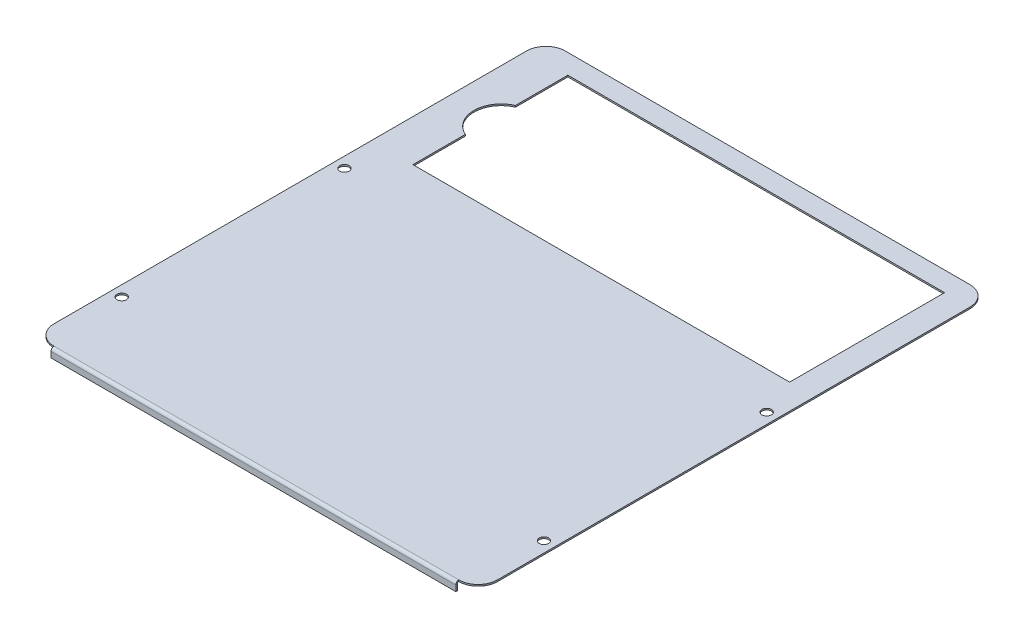
ISO-10303-21;
HEADER;
FILE_DESCRIPTION(('STEP AP214'),'2;1');
FILE_NAME('part.step','',(''),(''),'','','');
FILE_SCHEMA(('AUTOMOTIVE_DESIGN { 1 0 10303 214 1 1 1 1 }'));
ENDSEC;
DATA;
#1=APPLICATION_CONTEXT('core data for automotive mechanical design processes');
#2=APPLICATION_PROTOCOL_DEFINITION('international standard','automotive_design',2000,#1);
#3=PRODUCT_CONTEXT('',#1,'mechanical');
#4=PRODUCT('Part','Part','',(#3));
#5=PRODUCT_RELATED_PRODUCT_CATEGORY('part','',(#4));
#6=PRODUCT_DEFINITION_FORMATION('','',#4);
#7=PRODUCT_DEFINITION_CONTEXT('part definition',#1,'design');
#8=PRODUCT_DEFINITION('design','',#6,#7);
#9=PRODUCT_DEFINITION_SHAPE('','',#8);
#10=(LENGTH_UNIT() NAMED_UNIT(*) SI_UNIT(.MILLI.,.METRE.));
#11=(NAMED_UNIT(*) PLANE_ANGLE_UNIT() SI_UNIT($,.RADIAN.));
#12=(NAMED_UNIT(*) SI_UNIT($,.STERADIAN.) SOLID_ANGLE_UNIT());
#13=UNCERTAINTY_MEASURE_WITH_UNIT(LENGTH_MEASURE(1.E-05),#10,'distance_accuracy_value','');
#14=(GEOMETRIC_REPRESENTATION_CONTEXT(3) GLOBAL_UNCERTAINTY_ASSIGNED_CONTEXT((#13)) GLOBAL_UNIT_ASSIGNED_CONTEXT((#10,
#11,#12)) REPRESENTATION_CONTEXT('',''));
#15=CARTESIAN_POINT('',(0.,0.,0.));
#16=DIRECTION('',(0.,0.,1.));
#17=DIRECTION('',(1.,0.,0.));
#18=AXIS2_PLACEMENT_3D('',#15,#16,#17);
#19=CARTESIAN_POINT('',(114.5,-0.8,132.));
#20=DIRECTION('',(0.,1.,0.));
#21=DIRECTION('',(0.,0.,1.));
#22=AXIS2_PLACEMENT_3D('',#19,#20,#21);
#23=PLANE('',#22);
#24=DIRECTION('',(1.,0.,0.));
#25=VECTOR('',#24,1.);
#26=CARTESIAN_POINT('',(114.5,-0.8,-41.85));
#27=LINE('',#26,#25);
#28=CARTESIAN_POINT('',(-93.,-0.8,-41.85));
#29=VERTEX_POINT('',#28);
#30=CARTESIAN_POINT('',(101.5,-0.8,-41.85));
#31=VERTEX_POINT('',#30);
#32=EDGE_CURVE('E228',#29,#31,#27,.T.);
#33=ORIENTED_EDGE('',*,*,#32,.T.);
#34=DIRECTION('',(0.,0.,-1.));
#35=VECTOR('',#34,1.);
#36=CARTESIAN_POINT('',(101.5,-0.8,132.));
#37=LINE('',#36,#35);
#38=CARTESIAN_POINT('',(101.5,-0.8,-121.85));
#39=VERTEX_POINT('',#38);
#40=EDGE_CURVE('E231',#31,#39,#37,.T.);
#41=ORIENTED_EDGE('',*,*,#40,.T.);
#42=DIRECTION('',(-1.,0.,0.));
#43=VECTOR('',#42,1.);
#44=CARTESIAN_POINT('',(114.5,-0.8,-121.85));
#45=LINE('',#44,#43);
#46=CARTESIAN_POINT('',(-93.,-0.8,-121.85));
#47=VERTEX_POINT('',#46);
#48=EDGE_CURVE('E213',#39,#47,#45,.T.);
#49=ORIENTED_EDGE('',*,*,#48,.T.);
#50=DIRECTION('',(0.,0.,1.));
#51=VECTOR('',#50,1.);
#52=CARTESIAN_POINT('',(-93.,-0.8,132.));
#53=LINE('',#52,#51);
#54=CARTESIAN_POINT('',(-93.,-0.8,-94.8));
#55=VERTEX_POINT('',#54);
#56=EDGE_CURVE('E186',#47,#55,#53,.T.);
#57=ORIENTED_EDGE('',*,*,#56,.T.);
#58=CARTESIAN_POINT('',(-87.3851470588235,-0.8,-81.85));
#59=DIRECTION('',(0.,1.,0.));
#60=DIRECTION('',(0.,0.,1.));
#61=AXIS2_PLACEMENT_3D('',#58,#59,#60);
#62=CIRCLE('',#61,14.1148529411765);
#63=CARTESIAN_POINT('',(-93.,-0.8,-68.9));
#64=VERTEX_POINT('',#63);
#65=EDGE_CURVE('E222',#55,#64,#62,.T.);
#66=ORIENTED_EDGE('',*,*,#65,.T.);
#67=DIRECTION('',(0.,0.,1.));
#68=VECTOR('',#67,1.);
#69=CARTESIAN_POINT('',(-92.9999999999999,-0.8,132.));
#70=LINE('',#69,#68);
#71=EDGE_CURVE('E225',#64,#29,#70,.T.);
#72=ORIENTED_EDGE('',*,*,#71,.T.);
#73=EDGE_LOOP('',(#33,#41,#49,#57,#66,#72));
#74=FACE_BOUND('',#73,.T.);
#75=CARTESIAN_POINT('',(109.,-0.8,92.5));
#76=DIRECTION('',(0.,1.,0.));
#77=DIRECTION('',(0.,0.,1.));
#78=AXIS2_PLACEMENT_3D('',#75,#76,#77);
#79=CIRCLE('',#78,2.45);
#80=CARTESIAN_POINT('',(109.,-0.8,94.95));
#81=VERTEX_POINT('',#80);
#82=EDGE_CURVE('E243',#81,#81,#79,.F.);
#83=ORIENTED_EDGE('',*,*,#82,.F.);
#84=EDGE_LOOP('',(#83));
#85=FACE_BOUND('',#84,.T.);
#86=CARTESIAN_POINT('',(109.,-0.8,-22.5));
#87=DIRECTION('',(0.,1.,0.));
#88=DIRECTION('',(0.,0.,1.));
#89=AXIS2_PLACEMENT_3D('',#86,#87,#88);
#90=CIRCLE('',#89,2.45);
#91=CARTESIAN_POINT('',(109.,-0.8,-20.05));
#92=VERTEX_POINT('',#91);
#93=EDGE_CURVE('E238',#92,#92,#90,.F.);
#94=ORIENTED_EDGE('',*,*,#93,.F.);
#95=EDGE_LOOP('',(#94));
#96=FACE_BOUND('',#95,.T.);
#97=CARTESIAN_POINT('',(-109.,-0.8,92.5));
#98=DIRECTION('',(0.,1.,0.));
#99=DIRECTION('',(0.,0.,1.));
#100=AXIS2_PLACEMENT_3D('',#97,#98,#99);
#101=CIRCLE('',#100,2.45);
#102=CARTESIAN_POINT('',(-109.,-0.8,94.95));
#103=VERTEX_POINT('',#102);
#104=EDGE_CURVE('E255',#103,#103,#101,.T.);
#105=ORIENTED_EDGE('',*,*,#104,.T.);
#106=EDGE_LOOP('',(#105));
#107=FACE_BOUND('',#106,.T.);
#108=CARTESIAN_POINT('',(-109.,-0.8,-22.5));
#109=DIRECTION('',(0.,1.,0.));
#110=DIRECTION('',(0.,0.,1.));
#111=AXIS2_PLACEMENT_3D('',#108,#109,#110);
#112=CIRCLE('',#111,2.45);
#113=CARTESIAN_POINT('',(-109.,-0.8,-20.05));
#114=VERTEX_POINT('',#113);
#115=EDGE_CURVE('E250',#114,#114,#112,.T.);
#116=ORIENTED_EDGE('',*,*,#115,.T.);
#117=EDGE_LOOP('',(#116));
#118=FACE_BOUND('',#117,.T.);
#119=DIRECTION('',(-1.,0.,0.));
#120=VECTOR('',#119,1.);
#121=CARTESIAN_POINT('',(114.5,-0.8,132.));
#122=LINE('',#121,#120);
#123=CARTESIAN_POINT('',(104.5,-0.8,132.));
#124=VERTEX_POINT('',#123);
#125=CARTESIAN_POINT('',(-104.5,-0.8,132.));
#126=VERTEX_POINT('',#125);
#127=EDGE_CURVE('E312',#124,#126,#122,.T.);
#128=ORIENTED_EDGE('',*,*,#127,.T.);
#129=CARTESIAN_POINT('',(-104.5,-0.8,122.));
#130=DIRECTION('',(0.,1.,0.));
#131=DIRECTION('',(0.,0.,1.));
#132=AXIS2_PLACEMENT_3D('',#129,#130,#131);
#133=CIRCLE('',#132,10.);
#134=CARTESIAN_POINT('',(-114.5,-0.8,122.));
#135=VERTEX_POINT('',#134);
#136=EDGE_CURVE('E350',#126,#135,#133,.F.);
#137=ORIENTED_EDGE('',*,*,#136,.T.);
#138=DIRECTION('',(0.,0.,-1.));
#139=VECTOR('',#138,1.);
#140=CARTESIAN_POINT('',(-114.5,-0.8,132.));
#141=LINE('',#140,#139);
#142=CARTESIAN_POINT('',(-114.5,-0.8,-122.));
#143=VERTEX_POINT('',#142);
#144=EDGE_CURVE('E292',#135,#143,#141,.T.);
#145=ORIENTED_EDGE('',*,*,#144,.T.);
#146=CARTESIAN_POINT('',(-104.5,-0.8,-122.));
#147=DIRECTION('',(0.,1.,0.));
#148=DIRECTION('',(0.,0.,1.));
#149=AXIS2_PLACEMENT_3D('',#146,#147,#148);
#150=CIRCLE('',#149,10.);
#151=CARTESIAN_POINT('',(-104.5,-0.8,-132.));
#152=VERTEX_POINT('',#151);
#153=EDGE_CURVE('E348',#143,#152,#150,.F.);
#154=ORIENTED_EDGE('',*,*,#153,.T.);
#155=DIRECTION('',(-1.,0.,0.));
#156=VECTOR('',#155,1.);
#157=CARTESIAN_POINT('',(114.5,-0.8,-132.));
#158=LINE('',#157,#156);
#159=CARTESIAN_POINT('',(104.5,-0.8,-132.));
#160=VERTEX_POINT('',#159);
#161=EDGE_CURVE('E320',#160,#152,#158,.T.);
#162=ORIENTED_EDGE('',*,*,#161,.F.);
#163=CARTESIAN_POINT('',(104.5,-0.8,-122.));
#164=DIRECTION('',(0.,1.,0.));
#165=DIRECTION('',(0.,0.,1.));
#166=AXIS2_PLACEMENT_3D('',#163,#164,#165);
#167=CIRCLE('',#166,10.);
#168=CARTESIAN_POINT('',(114.5,-0.8,-122.));
#169=VERTEX_POINT('',#168);
#170=EDGE_CURVE('E346',#160,#169,#167,.F.);
#171=ORIENTED_EDGE('',*,*,#170,.T.);
#172=DIRECTION('',(0.,0.,-1.));
#173=VECTOR('',#172,1.);
#174=CARTESIAN_POINT('',(114.5,-0.8,132.));
#175=LINE('',#174,#173);
#176=CARTESIAN_POINT('',(114.5,-0.8,122.));
#177=VERTEX_POINT('',#176);
#178=EDGE_CURVE('E306',#177,#169,#175,.T.);
#179=ORIENTED_EDGE('',*,*,#178,.F.);
#180=CARTESIAN_POINT('',(104.5,-0.8,122.));
#181=DIRECTION('',(0.,1.,0.));
#182=DIRECTION('',(0.,0.,1.));
#183=AXIS2_PLACEMENT_3D('',#180,#181,#182);
#184=CIRCLE('',#183,10.);
#185=EDGE_CURVE('E344',#177,#124,#184,.F.);
#186=ORIENTED_EDGE('',*,*,#185,.T.);
#187=EDGE_LOOP('',(#128,#137,#145,#154,#162,#171,#179,#186));
#188=FACE_BOUND('',#187,.T.);
#189=ADVANCED_FACE('F56',(#74,#85,#96,#107,#118,#188),#23,.F.);
#190=CARTESIAN_POINT('',(114.5,0.,-132.));
#191=DIRECTION('',(0.,0.,-1.));
#192=DIRECTION('',(-1.,0.,0.));
#193=AXIS2_PLACEMENT_3D('',#190,#191,#192);
#194=PLANE('',#193);
#195=ORIENTED_EDGE('',*,*,#161,.T.);
#196=DIRECTION('',(0.,-1.,0.));
#197=VECTOR('',#196,1.);
#198=CARTESIAN_POINT('',(-104.5,0.,-132.));
#199=LINE('',#198,#197);
#200=CARTESIAN_POINT('',(-104.5,0.,-132.));
#201=VERTEX_POINT('',#200);
#202=EDGE_CURVE('E355',#152,#201,#199,.F.);
#203=ORIENTED_EDGE('',*,*,#202,.T.);
#204=DIRECTION('',(-1.,0.,0.));
#205=VECTOR('',#204,1.);
#206=CARTESIAN_POINT('',(114.5,0.,-132.));
#207=LINE('',#206,#205);
#208=CARTESIAN_POINT('',(104.5,0.,-132.));
#209=VERTEX_POINT('',#208);
#210=EDGE_CURVE('E317',#209,#201,#207,.T.);
#211=ORIENTED_EDGE('',*,*,#210,.F.);
#212=DIRECTION('',(0.,-1.,0.));
#213=VECTOR('',#212,1.);
#214=CARTESIAN_POINT('',(104.5,-0.8,-132.));
#215=LINE('',#214,#213);
#216=EDGE_CURVE('E352',#209,#160,#215,.T.);
#217=ORIENTED_EDGE('',*,*,#216,.T.);
#218=EDGE_LOOP('',(#195,#203,#211,#217));
#219=FACE_BOUND('',#218,.T.);
#220=ADVANCED_FACE('F410',(#219),#194,.T.);
#221=CARTESIAN_POINT('',(114.5,0.,132.));
#222=DIRECTION('',(0.,1.,0.));
#223=DIRECTION('',(0.,0.,1.));
#224=AXIS2_PLACEMENT_3D('',#221,#222,#223);
#225=PLANE('',#224);
#226=DIRECTION('',(0.,0.,-1.));
#227=VECTOR('',#226,1.);
#228=CARTESIAN_POINT('',(101.5,0.,-121.85));
#229=LINE('',#228,#227);
#230=CARTESIAN_POINT('',(101.5,0.,-41.85));
#231=VERTEX_POINT('',#230);
#232=CARTESIAN_POINT('',(101.5,0.,-121.85));
#233=VERTEX_POINT('',#232);
#234=EDGE_CURVE('E79',#231,#233,#229,.T.);
#235=ORIENTED_EDGE('',*,*,#234,.F.);
#236=DIRECTION('',(1.,0.,0.));
#237=VECTOR('',#236,1.);
#238=CARTESIAN_POINT('',(-93.,0.,-41.85));
#239=LINE('',#238,#237);
#240=CARTESIAN_POINT('',(-93.,0.,-41.85));
#241=VERTEX_POINT('',#240);
#242=EDGE_CURVE('E208',#241,#231,#239,.T.);
#243=ORIENTED_EDGE('',*,*,#242,.F.);
#244=DIRECTION('',(0.,0.,1.));
#245=VECTOR('',#244,1.);
#246=CARTESIAN_POINT('',(-93.,0.,-68.9));
#247=LINE('',#246,#245);
#248=CARTESIAN_POINT('',(-93.,0.,-68.9));
#249=VERTEX_POINT('',#248);
#250=EDGE_CURVE('E202',#249,#241,#247,.T.);
#251=ORIENTED_EDGE('',*,*,#250,.F.);
#252=CARTESIAN_POINT('',(-87.3851470588235,0.,-81.85));
#253=DIRECTION('',(0.,1.,0.));
#254=DIRECTION('',(0.,0.,-1.));
#255=AXIS2_PLACEMENT_3D('',#252,#253,#254);
#256=CIRCLE('',#255,14.1148529411765);
#257=CARTESIAN_POINT('',(-93.,0.,-94.8));
#258=VERTEX_POINT('',#257);
#259=EDGE_CURVE('E200',#258,#249,#256,.T.);
#260=ORIENTED_EDGE('',*,*,#259,.F.);
#261=DIRECTION('',(0.,0.,1.));
#262=VECTOR('',#261,1.);
#263=CARTESIAN_POINT('',(-93.,0.,-121.85));
#264=LINE('',#263,#262);
#265=CARTESIAN_POINT('',(-93.,0.,-121.85));
#266=VERTEX_POINT('',#265);
#267=EDGE_CURVE('E183',#266,#258,#264,.T.);
#268=ORIENTED_EDGE('',*,*,#267,.F.);
#269=DIRECTION('',(-1.,0.,0.));
#270=VECTOR('',#269,1.);
#271=CARTESIAN_POINT('',(-93.,0.,-121.85));
#272=LINE('',#271,#270);
#273=EDGE_CURVE('E192',#233,#266,#272,.T.);
#274=ORIENTED_EDGE('',*,*,#273,.F.);
#275=EDGE_LOOP('',(#235,#243,#251,#260,#268,#274));
#276=FACE_BOUND('',#275,.T.);
#277=CARTESIAN_POINT('',(109.,0.,92.5));
#278=DIRECTION('',(0.,-1.,0.));
#279=DIRECTION('',(0.,0.,1.));
#280=AXIS2_PLACEMENT_3D('',#277,#278,#279);
#281=CIRCLE('',#280,2.45);
#282=CARTESIAN_POINT('',(109.,0.,94.95));
#283=VERTEX_POINT('',#282);
#284=EDGE_CURVE('E235',#283,#283,#281,.T.);
#285=ORIENTED_EDGE('',*,*,#284,.T.);
#286=EDGE_LOOP('',(#285));
#287=FACE_BOUND('',#286,.T.);
#288=CARTESIAN_POINT('',(109.,0.,-22.5));
#289=DIRECTION('',(0.,-1.,0.));
#290=DIRECTION('',(0.,0.,1.));
#291=AXIS2_PLACEMENT_3D('',#288,#289,#290);
#292=CIRCLE('',#291,2.45);
#293=CARTESIAN_POINT('',(109.,0.,-20.05));
#294=VERTEX_POINT('',#293);
#295=EDGE_CURVE('E234',#294,#294,#292,.T.);
#296=ORIENTED_EDGE('',*,*,#295,.T.);
#297=EDGE_LOOP('',(#296));
#298=FACE_BOUND('',#297,.T.);
#299=CARTESIAN_POINT('',(-109.,0.,92.5));
#300=DIRECTION('',(0.,1.,0.));
#301=DIRECTION('',(0.,0.,1.));
#302=AXIS2_PLACEMENT_3D('',#299,#300,#301);
#303=CIRCLE('',#302,2.45);
#304=CARTESIAN_POINT('',(-109.,0.,94.95));
#305=VERTEX_POINT('',#304);
#306=EDGE_CURVE('E247',#305,#305,#303,.T.);
#307=ORIENTED_EDGE('',*,*,#306,.F.);
#308=EDGE_LOOP('',(#307));
#309=FACE_BOUND('',#308,.T.);
#310=CARTESIAN_POINT('',(-109.,0.,-22.5));
#311=DIRECTION('',(0.,1.,0.));
#312=DIRECTION('',(0.,0.,1.));
#313=AXIS2_PLACEMENT_3D('',#310,#311,#312);
#314=CIRCLE('',#313,2.45);
#315=CARTESIAN_POINT('',(-109.,0.,-20.05));
#316=VERTEX_POINT('',#315);
#317=EDGE_CURVE('E246',#316,#316,#314,.T.);
#318=ORIENTED_EDGE('',*,*,#317,.F.);
#319=EDGE_LOOP('',(#318));
#320=FACE_BOUND('',#319,.T.);
#321=DIRECTION('',(0.,0.,-1.));
#322=VECTOR('',#321,1.);
#323=CARTESIAN_POINT('',(-114.5,0.,132.));
#324=LINE('',#323,#322);
#325=CARTESIAN_POINT('',(-114.5,0.,122.));
#326=VERTEX_POINT('',#325);
#327=CARTESIAN_POINT('',(-114.5,0.,-122.));
#328=VERTEX_POINT('',#327);
#329=EDGE_CURVE('E303',#326,#328,#324,.T.);
#330=ORIENTED_EDGE('',*,*,#329,.F.);
#331=CARTESIAN_POINT('',(-104.5,0.,122.));
#332=DIRECTION('',(0.,1.,0.));
#333=DIRECTION('',(0.,0.,1.));
#334=AXIS2_PLACEMENT_3D('',#331,#332,#333);
#335=CIRCLE('',#334,10.);
#336=CARTESIAN_POINT('',(-104.5,0.,132.));
#337=VERTEX_POINT('',#336);
#338=EDGE_CURVE('E335',#326,#337,#335,.T.);
#339=ORIENTED_EDGE('',*,*,#338,.T.);
#340=DIRECTION('',(-1.,0.,0.));
#341=VECTOR('',#340,1.);
#342=CARTESIAN_POINT('',(114.5,0.,132.));
#343=LINE('',#342,#341);
#344=CARTESIAN_POINT('',(104.5,0.,132.));
#345=VERTEX_POINT('',#344);
#346=EDGE_CURVE('E314',#345,#337,#343,.T.);
#347=ORIENTED_EDGE('',*,*,#346,.F.);
#348=CARTESIAN_POINT('',(104.5,0.,122.));
#349=DIRECTION('',(0.,1.,0.));
#350=DIRECTION('',(0.,0.,1.));
#351=AXIS2_PLACEMENT_3D('',#348,#349,#350);
#352=CIRCLE('',#351,10.);
#353=CARTESIAN_POINT('',(114.5,0.,122.));
#354=VERTEX_POINT('',#353);
#355=EDGE_CURVE('E329',#345,#354,#352,.T.);
#356=ORIENTED_EDGE('',*,*,#355,.T.);
#357=DIRECTION('',(0.,0.,-1.));
#358=VECTOR('',#357,1.);
#359=CARTESIAN_POINT('',(114.5,0.,132.));
#360=LINE('',#359,#358);
#361=CARTESIAN_POINT('',(114.5,0.,-122.));
#362=VERTEX_POINT('',#361);
#363=EDGE_CURVE('E309',#354,#362,#360,.T.);
#364=ORIENTED_EDGE('',*,*,#363,.T.);
#365=CARTESIAN_POINT('',(104.5,0.,-122.));
#366=DIRECTION('',(0.,1.,0.));
#367=DIRECTION('',(0.,0.,1.));
#368=AXIS2_PLACEMENT_3D('',#365,#366,#367);
#369=CIRCLE('',#368,10.);
#370=EDGE_CURVE('E331',#362,#209,#369,.T.);
#371=ORIENTED_EDGE('',*,*,#370,.T.);
#372=ORIENTED_EDGE('',*,*,#210,.T.);
#373=CARTESIAN_POINT('',(-104.5,0.,-122.));
#374=DIRECTION('',(0.,1.,0.));
#375=DIRECTION('',(0.,0.,1.));
#376=AXIS2_PLACEMENT_3D('',#373,#374,#375);
#377=CIRCLE('',#376,10.);
#378=EDGE_CURVE('E333',#201,#328,#377,.T.);
#379=ORIENTED_EDGE('',*,*,#378,.T.);
#380=EDGE_LOOP('',(#330,#339,#347,#356,#364,#371,#372,#379));
#381=FACE_BOUND('',#380,.T.);
#382=ADVANCED_FACE('F196',(#276,#287,#298,#309,#320,#381),#225,.T.);
#383=CARTESIAN_POINT('',(114.5,0.,0.));
#384=DIRECTION('',(-1.,0.,0.));
#385=DIRECTION('',(0.,0.,1.));
#386=AXIS2_PLACEMENT_3D('',#383,#384,#385);
#387=PLANE('',#386);
#388=ORIENTED_EDGE('',*,*,#178,.T.);
#389=DIRECTION('',(0.,-1.,0.));
#390=VECTOR('',#389,1.);
#391=CARTESIAN_POINT('',(114.5,0.,-122.));
#392=LINE('',#391,#390);
#393=EDGE_CURVE('E13',#169,#362,#392,.F.);
#394=ORIENTED_EDGE('',*,*,#393,.T.);
#395=ORIENTED_EDGE('',*,*,#363,.F.);
#396=DIRECTION('',(0.,1.,0.));
#397=VECTOR('',#396,1.);
#398=CARTESIAN_POINT('',(114.5,-0.8,122.));
#399=LINE('',#398,#397);
#400=EDGE_CURVE('E64',#354,#177,#399,.F.);
#401=ORIENTED_EDGE('',*,*,#400,.T.);
#402=EDGE_LOOP('',(#388,#394,#395,#401));
#403=FACE_BOUND('',#402,.T.);
#404=ADVANCED_FACE('F360',(#403),#387,.F.);
#405=CARTESIAN_POINT('',(-114.5,0.,0.));
#406=DIRECTION('',(-1.,0.,0.));
#407=DIRECTION('',(0.,0.,1.));
#408=AXIS2_PLACEMENT_3D('',#405,#406,#407);
#409=PLANE('',#408);
#410=ORIENTED_EDGE('',*,*,#144,.F.);
#411=DIRECTION('',(0.,1.,0.));
#412=VECTOR('',#411,1.);
#413=CARTESIAN_POINT('',(-114.5,0.,122.));
#414=LINE('',#413,#412);
#415=EDGE_CURVE('E326',#135,#326,#414,.T.);
#416=ORIENTED_EDGE('',*,*,#415,.T.);
#417=ORIENTED_EDGE('',*,*,#329,.T.);
#418=DIRECTION('',(0.,-1.,0.));
#419=VECTOR('',#418,1.);
#420=CARTESIAN_POINT('',(-114.5,0.,-122.));
#421=LINE('',#420,#419);
#422=EDGE_CURVE('E323',#328,#143,#421,.T.);
#423=ORIENTED_EDGE('',*,*,#422,.T.);
#424=EDGE_LOOP('',(#410,#416,#417,#423));
#425=FACE_BOUND('',#424,.T.);
#426=ADVANCED_FACE('F425',(#425),#409,.T.);
#427=CARTESIAN_POINT('',(-104.5,0.,122.));
#428=DIRECTION('',(0.,1.,0.));
#429=DIRECTION('',(0.,0.,1.));
#430=AXIS2_PLACEMENT_3D('',#427,#428,#429);
#431=CYLINDRICAL_SURFACE('',#430,10.);
#432=ORIENTED_EDGE('',*,*,#136,.F.);
#433=DIRECTION('',(0.,1.,0.));
#434=VECTOR('',#433,1.);
#435=CARTESIAN_POINT('',(-104.5,-0.8,132.));
#436=LINE('',#435,#434);
#437=EDGE_CURVE('E341',#337,#126,#436,.F.);
#438=ORIENTED_EDGE('',*,*,#437,.F.);
#439=ORIENTED_EDGE('',*,*,#338,.F.);
#440=ORIENTED_EDGE('',*,*,#415,.F.);
#441=EDGE_LOOP('',(#432,#438,#439,#440));
#442=FACE_BOUND('',#441,.T.);
#443=ADVANCED_FACE('F421',(#442),#431,.T.);
#444=CARTESIAN_POINT('',(-104.5,0.,-122.));
#445=DIRECTION('',(0.,-1.,0.));
#446=DIRECTION('',(0.,0.,-1.));
#447=AXIS2_PLACEMENT_3D('',#444,#445,#446);
#448=CYLINDRICAL_SURFACE('',#447,10.);
#449=ORIENTED_EDGE('',*,*,#378,.F.);
#450=ORIENTED_EDGE('',*,*,#202,.F.);
#451=ORIENTED_EDGE('',*,*,#153,.F.);
#452=ORIENTED_EDGE('',*,*,#422,.F.);
#453=EDGE_LOOP('',(#449,#450,#451,#452));
#454=FACE_BOUND('',#453,.T.);
#455=ADVANCED_FACE('F424',(#454),#448,.T.);
#456=CARTESIAN_POINT('',(104.5,0.,-122.));
#457=DIRECTION('',(0.,1.,0.));
#458=DIRECTION('',(0.,0.,1.));
#459=AXIS2_PLACEMENT_3D('',#456,#457,#458);
#460=CYLINDRICAL_SURFACE('',#459,10.);
#461=ORIENTED_EDGE('',*,*,#370,.F.);
#462=ORIENTED_EDGE('',*,*,#393,.F.);
#463=ORIENTED_EDGE('',*,*,#170,.F.);
#464=ORIENTED_EDGE('',*,*,#216,.F.);
#465=EDGE_LOOP('',(#461,#462,#463,#464));
#466=FACE_BOUND('',#465,.T.);
#467=ADVANCED_FACE('F428',(#466),#460,.T.);
#468=CARTESIAN_POINT('',(104.5,-0.8,122.));
#469=DIRECTION('',(0.,-1.,0.));
#470=DIRECTION('',(0.,0.,-1.));
#471=AXIS2_PLACEMENT_3D('',#468,#469,#470);
#472=CYLINDRICAL_SURFACE('',#471,10.);
#473=ORIENTED_EDGE('',*,*,#185,.F.);
#474=ORIENTED_EDGE('',*,*,#400,.F.);
#475=ORIENTED_EDGE('',*,*,#355,.F.);
#476=DIRECTION('',(0.,1.,0.));
#477=VECTOR('',#476,1.);
#478=CARTESIAN_POINT('',(104.5,0.,132.));
#479=LINE('',#478,#477);
#480=EDGE_CURVE('E338',#124,#345,#479,.T.);
#481=ORIENTED_EDGE('',*,*,#480,.F.);
#482=EDGE_LOOP('',(#473,#474,#475,#481));
#483=FACE_BOUND('',#482,.T.);
#484=ADVANCED_FACE('F58',(#483),#472,.T.);
#485=CARTESIAN_POINT('',(104.5,-1.5366,132.));
#486=DIRECTION('',(1.,0.,0.));
#487=DIRECTION('',(0.,0.,-1.));
#488=AXIS2_PLACEMENT_3D('',#485,#486,#487);
#489=PLANE('',#488);
#490=DIRECTION('',(0.,0.,-1.));
#491=VECTOR('',#490,1.);
#492=CARTESIAN_POINT('',(104.5,-1.5366,133.5366));
#493=LINE('',#492,#491);
#494=CARTESIAN_POINT('',(104.5,-1.5366,132.7366));
#495=VERTEX_POINT('',#494);
#496=CARTESIAN_POINT('',(104.5,-1.5366,133.5366));
#497=VERTEX_POINT('',#496);
#498=EDGE_CURVE('E258',#495,#497,#493,.F.);
#499=ORIENTED_EDGE('',*,*,#498,.F.);
#500=CARTESIAN_POINT('',(104.5,-1.5366,132.));
#501=DIRECTION('',(-1.,0.,0.));
#502=DIRECTION('',(0.,0.,1.));
#503=AXIS2_PLACEMENT_3D('',#500,#501,#502);
#504=CIRCLE('',#503,0.736600000000004);
#505=EDGE_CURVE('E296',#124,#495,#504,.F.);
#506=ORIENTED_EDGE('',*,*,#505,.F.);
#507=ORIENTED_EDGE('',*,*,#480,.T.);
#508=CARTESIAN_POINT('',(104.5,-1.5366,132.));
#509=DIRECTION('',(-1.,0.,0.));
#510=DIRECTION('',(0.,0.,1.));
#511=AXIS2_PLACEMENT_3D('',#508,#509,#510);
#512=CIRCLE('',#511,1.5366);
#513=EDGE_CURVE('E289',#345,#497,#512,.F.);
#514=ORIENTED_EDGE('',*,*,#513,.T.);
#515=EDGE_LOOP('',(#499,#506,#507,#514));
#516=FACE_BOUND('',#515,.T.);
#517=ADVANCED_FACE('F377',(#516),#489,.T.);
#518=CARTESIAN_POINT('',(-104.5,-1.5366,132.));
#519=DIRECTION('',(1.,0.,0.));
#520=DIRECTION('',(0.,0.,-1.));
#521=AXIS2_PLACEMENT_3D('',#518,#519,#520);
#522=PLANE('',#521);
#523=CARTESIAN_POINT('',(-104.5,-1.5366,132.));
#524=DIRECTION('',(-1.,0.,0.));
#525=DIRECTION('',(0.,0.,1.));
#526=AXIS2_PLACEMENT_3D('',#523,#524,#525);
#527=CIRCLE('',#526,0.736600000000004);
#528=CARTESIAN_POINT('',(-104.5,-1.5366,132.7366));
#529=VERTEX_POINT('',#528);
#530=EDGE_CURVE('E262',#529,#126,#527,.T.);
#531=ORIENTED_EDGE('',*,*,#530,.F.);
#532=DIRECTION('',(0.,0.,-1.));
#533=VECTOR('',#532,1.);
#534=CARTESIAN_POINT('',(-104.5,-1.5366,132.7366));
#535=LINE('',#534,#533);
#536=CARTESIAN_POINT('',(-104.5,-1.5366,133.5366));
#537=VERTEX_POINT('',#536);
#538=EDGE_CURVE('E282',#529,#537,#535,.F.);
#539=ORIENTED_EDGE('',*,*,#538,.T.);
#540=CARTESIAN_POINT('',(-104.5,-1.5366,132.));
#541=DIRECTION('',(-1.,0.,0.));
#542=DIRECTION('',(0.,0.,1.));
#543=AXIS2_PLACEMENT_3D('',#540,#541,#542);
#544=CIRCLE('',#543,1.5366);
#545=EDGE_CURVE('E293',#537,#337,#544,.T.);
#546=ORIENTED_EDGE('',*,*,#545,.T.);
#547=ORIENTED_EDGE('',*,*,#437,.T.);
#548=EDGE_LOOP('',(#531,#539,#546,#547));
#549=FACE_BOUND('',#548,.T.);
#550=ADVANCED_FACE('F397',(#549),#522,.F.);
#551=CARTESIAN_POINT('',(-104.5,-1.5366,132.));
#552=DIRECTION('',(-1.,0.,0.));
#553=DIRECTION('',(0.,0.,1.));
#554=AXIS2_PLACEMENT_3D('',#551,#552,#553);
#555=CYLINDRICAL_SURFACE('',#554,1.5366);
#556=ORIENTED_EDGE('',*,*,#346,.T.);
#557=ORIENTED_EDGE('',*,*,#545,.F.);
#558=DIRECTION('',(-1.,0.,0.));
#559=VECTOR('',#558,1.);
#560=CARTESIAN_POINT('',(104.5,-1.5366,133.5366));
#561=LINE('',#560,#559);
#562=EDGE_CURVE('E280',#537,#497,#561,.F.);
#563=ORIENTED_EDGE('',*,*,#562,.T.);
#564=ORIENTED_EDGE('',*,*,#513,.F.);
#565=EDGE_LOOP('',(#556,#557,#563,#564));
#566=FACE_BOUND('',#565,.T.);
#567=ADVANCED_FACE('F447',(#566),#555,.T.);
#568=CARTESIAN_POINT('',(-104.5,-1.5366,132.));
#569=DIRECTION('',(-1.,0.,0.));
#570=DIRECTION('',(0.,0.,1.));
#571=AXIS2_PLACEMENT_3D('',#568,#569,#570);
#572=CYLINDRICAL_SURFACE('',#571,0.736600000000004);
#573=ORIENTED_EDGE('',*,*,#127,.F.);
#574=ORIENTED_EDGE('',*,*,#505,.T.);
#575=DIRECTION('',(-1.,0.,0.));
#576=VECTOR('',#575,1.);
#577=CARTESIAN_POINT('',(104.5,-1.5366,132.7366));
#578=LINE('',#577,#576);
#579=EDGE_CURVE('E285',#495,#529,#578,.T.);
#580=ORIENTED_EDGE('',*,*,#579,.T.);
#581=ORIENTED_EDGE('',*,*,#530,.T.);
#582=EDGE_LOOP('',(#573,#574,#580,#581));
#583=FACE_BOUND('',#582,.T.);
#584=ADVANCED_FACE('F373',(#583),#572,.F.);
#585=CARTESIAN_POINT('',(104.5,-0.799999999999997,133.5366));
#586=DIRECTION('',(-1.,0.,0.));
#587=DIRECTION('',(0.,0.,1.));
#588=AXIS2_PLACEMENT_3D('',#585,#586,#587);
#589=PLANE('',#588);
#590=ORIENTED_EDGE('',*,*,#498,.T.);
#591=DIRECTION('',(0.,1.,0.));
#592=VECTOR('',#591,1.);
#593=CARTESIAN_POINT('',(104.5,0.,133.5366));
#594=LINE('',#593,#592);
#595=CARTESIAN_POINT('',(104.5,-4.5,133.5366));
#596=VERTEX_POINT('',#595);
#597=EDGE_CURVE('E270',#596,#497,#594,.T.);
#598=ORIENTED_EDGE('',*,*,#597,.F.);
#599=DIRECTION('',(0.,0.,-1.));
#600=VECTOR('',#599,1.);
#601=CARTESIAN_POINT('',(104.5,-4.5,133.5366));
#602=LINE('',#601,#600);
#603=CARTESIAN_POINT('',(104.5,-4.5,132.7366));
#604=VERTEX_POINT('',#603);
#605=EDGE_CURVE('E263',#596,#604,#602,.T.);
#606=ORIENTED_EDGE('',*,*,#605,.T.);
#607=DIRECTION('',(0.,-1.,0.));
#608=VECTOR('',#607,1.);
#609=CARTESIAN_POINT('',(104.5,-0.799999999999997,132.7366));
#610=LINE('',#609,#608);
#611=EDGE_CURVE('E277',#604,#495,#610,.F.);
#612=ORIENTED_EDGE('',*,*,#611,.T.);
#613=EDGE_LOOP('',(#590,#598,#606,#612));
#614=FACE_BOUND('',#613,.T.);
#615=ADVANCED_FACE('F380',(#614),#589,.F.);
#616=CARTESIAN_POINT('',(-104.5,-4.5,133.5366));
#617=DIRECTION('',(1.,0.,0.));
#618=DIRECTION('',(0.,0.,-1.));
#619=AXIS2_PLACEMENT_3D('',#616,#617,#618);
#620=PLANE('',#619);
#621=ORIENTED_EDGE('',*,*,#538,.F.);
#622=DIRECTION('',(0.,1.,0.));
#623=VECTOR('',#622,1.);
#624=CARTESIAN_POINT('',(-104.5,-4.5,132.7366));
#625=LINE('',#624,#623);
#626=CARTESIAN_POINT('',(-104.5,-4.5,132.7366));
#627=VERTEX_POINT('',#626);
#628=EDGE_CURVE('E275',#529,#627,#625,.F.);
#629=ORIENTED_EDGE('',*,*,#628,.T.);
#630=DIRECTION('',(0.,0.,-1.));
#631=VECTOR('',#630,1.);
#632=CARTESIAN_POINT('',(-104.5,-4.5,133.5366));
#633=LINE('',#632,#631);
#634=CARTESIAN_POINT('',(-104.5,-4.5,133.5366));
#635=VERTEX_POINT('',#634);
#636=EDGE_CURVE('E259',#635,#627,#633,.T.);
#637=ORIENTED_EDGE('',*,*,#636,.F.);
#638=DIRECTION('',(0.,-1.,0.));
#639=VECTOR('',#638,1.);
#640=CARTESIAN_POINT('',(-104.5,0.,133.5366));
#641=LINE('',#640,#639);
#642=EDGE_CURVE('E268',#537,#635,#641,.T.);
#643=ORIENTED_EDGE('',*,*,#642,.F.);
#644=EDGE_LOOP('',(#621,#629,#637,#643));
#645=FACE_BOUND('',#644,.T.);
#646=ADVANCED_FACE('F399',(#645),#620,.F.);
#647=CARTESIAN_POINT('',(0.,0.,133.5366));
#648=DIRECTION('',(0.,0.,-1.));
#649=DIRECTION('',(-1.,0.,0.));
#650=AXIS2_PLACEMENT_3D('',#647,#648,#649);
#651=PLANE('',#650);
#652=ORIENTED_EDGE('',*,*,#562,.F.);
#653=ORIENTED_EDGE('',*,*,#642,.T.);
#654=DIRECTION('',(1.,0.,0.));
#655=VECTOR('',#654,1.);
#656=CARTESIAN_POINT('',(0.,-4.5,133.5366));
#657=LINE('',#656,#655);
#658=EDGE_CURVE('E266',#635,#596,#657,.T.);
#659=ORIENTED_EDGE('',*,*,#658,.T.);
#660=ORIENTED_EDGE('',*,*,#597,.T.);
#661=EDGE_LOOP('',(#652,#653,#659,#660));
#662=FACE_BOUND('',#661,.T.);
#663=ADVANCED_FACE('F384',(#662),#651,.F.);
#664=CARTESIAN_POINT('',(0.,0.,132.7366));
#665=DIRECTION('',(0.,0.,-1.));
#666=DIRECTION('',(-1.,0.,0.));
#667=AXIS2_PLACEMENT_3D('',#664,#665,#666);
#668=PLANE('',#667);
#669=ORIENTED_EDGE('',*,*,#628,.F.);
#670=ORIENTED_EDGE('',*,*,#579,.F.);
#671=ORIENTED_EDGE('',*,*,#611,.F.);
#672=DIRECTION('',(-1.,0.,0.));
#673=VECTOR('',#672,1.);
#674=CARTESIAN_POINT('',(104.5,-4.5,132.7366));
#675=LINE('',#674,#673);
#676=EDGE_CURVE('E273',#627,#604,#675,.F.);
#677=ORIENTED_EDGE('',*,*,#676,.F.);
#678=EDGE_LOOP('',(#669,#670,#671,#677));
#679=FACE_BOUND('',#678,.T.);
#680=ADVANCED_FACE('F394',(#679),#668,.T.);
#681=CARTESIAN_POINT('',(104.5,-4.5,133.5366));
#682=DIRECTION('',(0.,1.,0.));
#683=DIRECTION('',(0.,0.,1.));
#684=AXIS2_PLACEMENT_3D('',#681,#682,#683);
#685=PLANE('',#684);
#686=ORIENTED_EDGE('',*,*,#676,.T.);
#687=ORIENTED_EDGE('',*,*,#605,.F.);
#688=ORIENTED_EDGE('',*,*,#658,.F.);
#689=ORIENTED_EDGE('',*,*,#636,.T.);
#690=EDGE_LOOP('',(#686,#687,#688,#689));
#691=FACE_BOUND('',#690,.T.);
#692=ADVANCED_FACE('F390',(#691),#685,.F.);
#693=CARTESIAN_POINT('',(-109.,-4.5,-22.5));
#694=DIRECTION('',(0.,1.,0.));
#695=DIRECTION('',(0.,0.,1.));
#696=AXIS2_PLACEMENT_3D('',#693,#694,#695);
#697=CYLINDRICAL_SURFACE('',#696,2.45);
#698=ORIENTED_EDGE('',*,*,#317,.T.);
#699=EDGE_LOOP('',(#698));
#700=FACE_BOUND('',#699,.T.);
#701=ORIENTED_EDGE('',*,*,#115,.F.);
#702=EDGE_LOOP('',(#701));
#703=FACE_BOUND('',#702,.T.);
#704=ADVANCED_FACE('F561',(#700,#703),#697,.F.);
#705=CARTESIAN_POINT('',(-109.,-4.5,92.5));
#706=DIRECTION('',(0.,1.,0.));
#707=DIRECTION('',(0.,0.,1.));
#708=AXIS2_PLACEMENT_3D('',#705,#706,#707);
#709=CYLINDRICAL_SURFACE('',#708,2.45);
#710=ORIENTED_EDGE('',*,*,#306,.T.);
#711=EDGE_LOOP('',(#710));
#712=FACE_BOUND('',#711,.T.);
#713=ORIENTED_EDGE('',*,*,#104,.F.);
#714=EDGE_LOOP('',(#713));
#715=FACE_BOUND('',#714,.T.);
#716=ADVANCED_FACE('F570',(#712,#715),#709,.F.);
#717=CARTESIAN_POINT('',(109.,-4.5,-22.5));
#718=DIRECTION('',(0.,1.,0.));
#719=DIRECTION('',(0.,0.,1.));
#720=AXIS2_PLACEMENT_3D('',#717,#718,#719);
#721=CYLINDRICAL_SURFACE('',#720,2.45);
#722=ORIENTED_EDGE('',*,*,#295,.F.);
#723=EDGE_LOOP('',(#722));
#724=FACE_BOUND('',#723,.T.);
#725=ORIENTED_EDGE('',*,*,#93,.T.);
#726=EDGE_LOOP('',(#725));
#727=FACE_BOUND('',#726,.T.);
#728=ADVANCED_FACE('F581',(#724,#727),#721,.F.);
#729=CARTESIAN_POINT('',(109.,-4.5,92.5));
#730=DIRECTION('',(0.,1.,0.));
#731=DIRECTION('',(0.,0.,1.));
#732=AXIS2_PLACEMENT_3D('',#729,#730,#731);
#733=CYLINDRICAL_SURFACE('',#732,2.45);
#734=ORIENTED_EDGE('',*,*,#284,.F.);
#735=EDGE_LOOP('',(#734));
#736=FACE_BOUND('',#735,.T.);
#737=ORIENTED_EDGE('',*,*,#82,.T.);
#738=EDGE_LOOP('',(#737));
#739=FACE_BOUND('',#738,.T.);
#740=ADVANCED_FACE('F592',(#736,#739),#733,.F.);
#741=CARTESIAN_POINT('',(101.5,-4.5,-121.85));
#742=DIRECTION('',(1.,0.,0.));
#743=DIRECTION('',(0.,0.,-1.));
#744=AXIS2_PLACEMENT_3D('',#741,#742,#743);
#745=PLANE('',#744);
#746=DIRECTION('',(0.,1.,0.));
#747=VECTOR('',#746,1.);
#748=CARTESIAN_POINT('',(101.5,-4.5,-41.85));
#749=LINE('',#748,#747);
#750=EDGE_CURVE('E211',#31,#231,#749,.T.);
#751=ORIENTED_EDGE('',*,*,#750,.T.);
#752=ORIENTED_EDGE('',*,*,#234,.T.);
#753=DIRECTION('',(0.,1.,0.));
#754=VECTOR('',#753,1.);
#755=CARTESIAN_POINT('',(101.5,-4.5,-121.85));
#756=LINE('',#755,#754);
#757=EDGE_CURVE('E189',#39,#233,#756,.T.);
#758=ORIENTED_EDGE('',*,*,#757,.F.);
#759=ORIENTED_EDGE('',*,*,#40,.F.);
#760=EDGE_LOOP('',(#751,#752,#758,#759));
#761=FACE_BOUND('',#760,.T.);
#762=ADVANCED_FACE('F603',(#761),#745,.F.);
#763=CARTESIAN_POINT('',(-93.,-4.5,-41.85));
#764=DIRECTION('',(0.,0.,1.));
#765=DIRECTION('',(1.,0.,0.));
#766=AXIS2_PLACEMENT_3D('',#763,#764,#765);
#767=PLANE('',#766);
#768=DIRECTION('',(0.,1.,0.));
#769=VECTOR('',#768,1.);
#770=CARTESIAN_POINT('',(-93.,-4.5,-41.85));
#771=LINE('',#770,#769);
#772=EDGE_CURVE('E214',#29,#241,#771,.T.);
#773=ORIENTED_EDGE('',*,*,#772,.T.);
#774=ORIENTED_EDGE('',*,*,#242,.T.);
#775=ORIENTED_EDGE('',*,*,#750,.F.);
#776=ORIENTED_EDGE('',*,*,#32,.F.);
#777=EDGE_LOOP('',(#773,#774,#775,#776));
#778=FACE_BOUND('',#777,.T.);
#779=ADVANCED_FACE('F613',(#778),#767,.F.);
#780=CARTESIAN_POINT('',(-93.,-4.5,-68.9));
#781=DIRECTION('',(-1.,0.,0.));
#782=DIRECTION('',(0.,0.,1.));
#783=AXIS2_PLACEMENT_3D('',#780,#781,#782);
#784=PLANE('',#783);
#785=DIRECTION('',(0.,1.,0.));
#786=VECTOR('',#785,1.);
#787=CARTESIAN_POINT('',(-93.,-4.5,-68.9));
#788=LINE('',#787,#786);
#789=EDGE_CURVE('E216',#64,#249,#788,.T.);
#790=ORIENTED_EDGE('',*,*,#789,.T.);
#791=ORIENTED_EDGE('',*,*,#250,.T.);
#792=ORIENTED_EDGE('',*,*,#772,.F.);
#793=ORIENTED_EDGE('',*,*,#71,.F.);
#794=EDGE_LOOP('',(#790,#791,#792,#793));
#795=FACE_BOUND('',#794,.T.);
#796=ADVANCED_FACE('F623',(#795),#784,.F.);
#797=CARTESIAN_POINT('',(-87.3851470588235,-4.5,-81.85));
#798=DIRECTION('',(0.,1.,0.));
#799=DIRECTION('',(0.,0.,1.));
#800=AXIS2_PLACEMENT_3D('',#797,#798,#799);
#801=CYLINDRICAL_SURFACE('',#800,14.1148529411765);
#802=DIRECTION('',(0.,1.,0.));
#803=VECTOR('',#802,1.);
#804=CARTESIAN_POINT('',(-93.,-4.5,-94.8));
#805=LINE('',#804,#803);
#806=EDGE_CURVE('E188',#55,#258,#805,.T.);
#807=ORIENTED_EDGE('',*,*,#806,.T.);
#808=ORIENTED_EDGE('',*,*,#259,.T.);
#809=ORIENTED_EDGE('',*,*,#789,.F.);
#810=ORIENTED_EDGE('',*,*,#65,.F.);
#811=EDGE_LOOP('',(#807,#808,#809,#810));
#812=FACE_BOUND('',#811,.T.);
#813=ADVANCED_FACE('F634',(#812),#801,.F.);
#814=CARTESIAN_POINT('',(-93.,-4.5,-121.85));
#815=DIRECTION('',(-1.,0.,0.));
#816=DIRECTION('',(0.,0.,1.));
#817=AXIS2_PLACEMENT_3D('',#814,#815,#816);
#818=PLANE('',#817);
#819=DIRECTION('',(0.,1.,0.));
#820=VECTOR('',#819,1.);
#821=CARTESIAN_POINT('',(-93.,-4.5,-121.85));
#822=LINE('',#821,#820);
#823=EDGE_CURVE('E71',#47,#266,#822,.T.);
#824=ORIENTED_EDGE('',*,*,#823,.T.);
#825=ORIENTED_EDGE('',*,*,#267,.T.);
#826=ORIENTED_EDGE('',*,*,#806,.F.);
#827=ORIENTED_EDGE('',*,*,#56,.F.);
#828=EDGE_LOOP('',(#824,#825,#826,#827));
#829=FACE_BOUND('',#828,.T.);
#830=ADVANCED_FACE('F180',(#829),#818,.F.);
#831=CARTESIAN_POINT('',(-93.,-4.5,-121.85));
#832=DIRECTION('',(0.,0.,-1.));
#833=DIRECTION('',(-1.,0.,0.));
#834=AXIS2_PLACEMENT_3D('',#831,#832,#833);
#835=PLANE('',#834);
#836=ORIENTED_EDGE('',*,*,#757,.T.);
#837=ORIENTED_EDGE('',*,*,#273,.T.);
#838=ORIENTED_EDGE('',*,*,#823,.F.);
#839=ORIENTED_EDGE('',*,*,#48,.F.);
#840=EDGE_LOOP('',(#836,#837,#838,#839));
#841=FACE_BOUND('',#840,.T.);
#842=ADVANCED_FACE('F193',(#841),#835,.F.);
#843=CLOSED_SHELL('',(#189,#220,#382,#404,#426,#443,#455,#467,#484,#517,#550,#567,#584,#615,
#646,#663,#680,#692,#704,#716,#728,#740,#762,#779,#796,#813,#830,#842));
#844=MANIFOLD_SOLID_BREP('B2',#843);
#845=ADVANCED_BREP_SHAPE_REPRESENTATION('',(#18,#844),#14);
#846=SHAPE_DEFINITION_REPRESENTATION(#9,#845);
ENDSEC;
END-ISO-10303-21;
